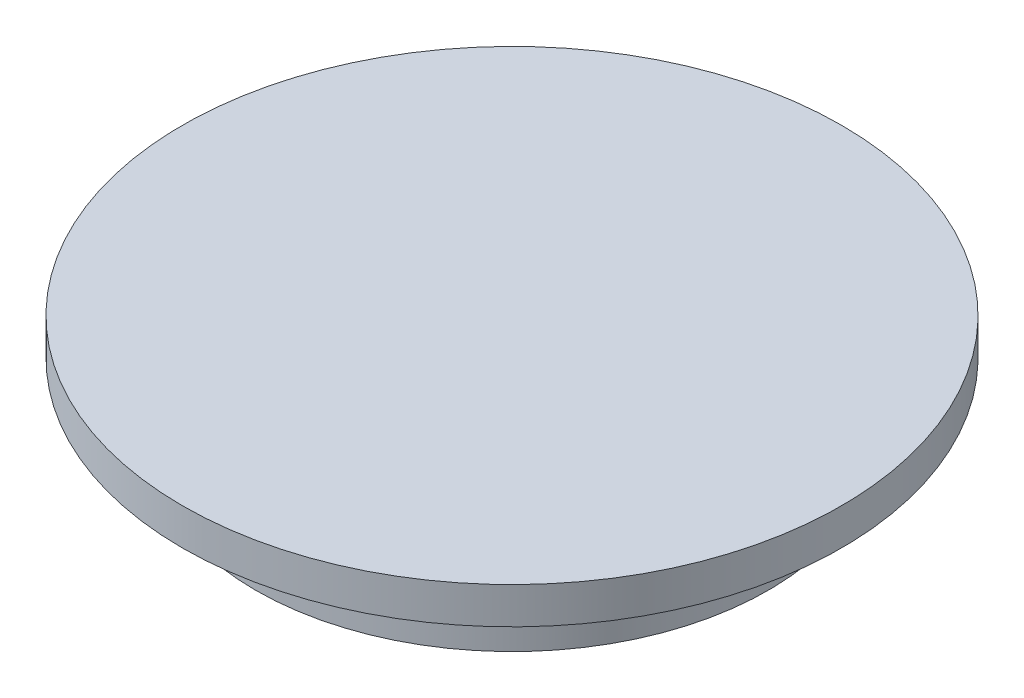
ISO-10303-21;
HEADER;
FILE_DESCRIPTION(('STEP AP214'),'2;1');
FILE_NAME('part.step','',(''),(''),'','','');
FILE_SCHEMA(('AUTOMOTIVE_DESIGN { 1 0 10303 214 1 1 1 1 }'));
ENDSEC;
DATA;
#1=APPLICATION_CONTEXT('core data for automotive mechanical design processes');
#2=APPLICATION_PROTOCOL_DEFINITION('international standard','automotive_design',2000,#1);
#3=PRODUCT_CONTEXT('',#1,'mechanical');
#4=PRODUCT('Part','Part','',(#3));
#5=PRODUCT_RELATED_PRODUCT_CATEGORY('part','',(#4));
#6=PRODUCT_DEFINITION_FORMATION('','',#4);
#7=PRODUCT_DEFINITION_CONTEXT('part definition',#1,'design');
#8=PRODUCT_DEFINITION('design','',#6,#7);
#9=PRODUCT_DEFINITION_SHAPE('','',#8);
#10=(LENGTH_UNIT() NAMED_UNIT(*) SI_UNIT(.MILLI.,.METRE.));
#11=(NAMED_UNIT(*) PLANE_ANGLE_UNIT() SI_UNIT($,.RADIAN.));
#12=(NAMED_UNIT(*) SI_UNIT($,.STERADIAN.) SOLID_ANGLE_UNIT());
#13=UNCERTAINTY_MEASURE_WITH_UNIT(LENGTH_MEASURE(1.E-05),#10,'distance_accuracy_value','');
#14=(GEOMETRIC_REPRESENTATION_CONTEXT(3) GLOBAL_UNCERTAINTY_ASSIGNED_CONTEXT((#13)) GLOBAL_UNIT_ASSIGNED_CONTEXT((#10,
#11,#12)) REPRESENTATION_CONTEXT('',''));
#15=CARTESIAN_POINT('',(0.,0.,0.));
#16=DIRECTION('',(0.,0.,1.));
#17=DIRECTION('',(1.,0.,0.));
#18=AXIS2_PLACEMENT_3D('',#15,#16,#17);
#19=CARTESIAN_POINT('',(0.,5.,0.));
#20=DIRECTION('',(0.,-1.,0.));
#21=DIRECTION('',(0.,0.,-1.));
#22=AXIS2_PLACEMENT_3D('',#19,#20,#21);
#23=CYLINDRICAL_SURFACE('',#22,17.5);
#24=CARTESIAN_POINT('',(0.,5.,0.));
#25=DIRECTION('',(0.,1.,0.));
#26=DIRECTION('',(0.,0.,1.));
#27=AXIS2_PLACEMENT_3D('',#24,#25,#26);
#28=CIRCLE('',#27,17.5);
#29=CARTESIAN_POINT('',(0.,5.,17.5));
#30=VERTEX_POINT('',#29);
#31=EDGE_CURVE('E10',#30,#30,#28,.T.);
#32=ORIENTED_EDGE('',*,*,#31,.F.);
#33=EDGE_LOOP('',(#32));
#34=FACE_BOUND('',#33,.T.);
#35=CARTESIAN_POINT('',(0.,0.,0.));
#36=DIRECTION('',(0.,1.,0.));
#37=DIRECTION('',(0.,0.,1.));
#38=AXIS2_PLACEMENT_3D('',#35,#36,#37);
#39=CIRCLE('',#38,17.5);
#40=CARTESIAN_POINT('',(0.,0.,17.5));
#41=VERTEX_POINT('',#40);
#42=EDGE_CURVE('E40',#41,#41,#39,.T.);
#43=ORIENTED_EDGE('',*,*,#42,.T.);
#44=EDGE_LOOP('',(#43));
#45=FACE_BOUND('',#44,.T.);
#46=ADVANCED_FACE('F37',(#34,#45),#23,.T.);
#47=CARTESIAN_POINT('',(0.,0.,0.));
#48=DIRECTION('',(0.,1.,0.));
#49=DIRECTION('',(0.,0.,1.));
#50=AXIS2_PLACEMENT_3D('',#47,#48,#49);
#51=PLANE('',#50);
#52=ORIENTED_EDGE('',*,*,#42,.F.);
#53=EDGE_LOOP('',(#52));
#54=FACE_BOUND('',#53,.T.);
#55=ADVANCED_FACE('F60',(#54),#51,.F.);
#56=CARTESIAN_POINT('',(0.,7.5,0.));
#57=DIRECTION('',(0.,-1.,0.));
#58=DIRECTION('',(0.,0.,-1.));
#59=AXIS2_PLACEMENT_3D('',#56,#57,#58);
#60=CYLINDRICAL_SURFACE('',#59,22.5);
#61=CARTESIAN_POINT('',(0.,7.5,0.));
#62=DIRECTION('',(0.,1.,0.));
#63=DIRECTION('',(0.,0.,1.));
#64=AXIS2_PLACEMENT_3D('',#61,#62,#63);
#65=CIRCLE('',#64,22.5);
#66=CARTESIAN_POINT('',(0.,7.5,22.5));
#67=VERTEX_POINT('',#66);
#68=EDGE_CURVE('E47',#67,#67,#65,.T.);
#69=ORIENTED_EDGE('',*,*,#68,.F.);
#70=EDGE_LOOP('',(#69));
#71=FACE_BOUND('',#70,.T.);
#72=CARTESIAN_POINT('',(0.,5.,0.));
#73=DIRECTION('',(0.,1.,0.));
#74=DIRECTION('',(0.,0.,1.));
#75=AXIS2_PLACEMENT_3D('',#72,#73,#74);
#76=CIRCLE('',#75,22.5);
#77=CARTESIAN_POINT('',(0.,5.,22.5));
#78=VERTEX_POINT('',#77);
#79=EDGE_CURVE('E49',#78,#78,#76,.T.);
#80=ORIENTED_EDGE('',*,*,#79,.T.);
#81=EDGE_LOOP('',(#80));
#82=FACE_BOUND('',#81,.T.);
#83=ADVANCED_FACE('F57',(#71,#82),#60,.T.);
#84=CARTESIAN_POINT('',(0.,7.5,0.));
#85=DIRECTION('',(0.,1.,0.));
#86=DIRECTION('',(0.,0.,1.));
#87=AXIS2_PLACEMENT_3D('',#84,#85,#86);
#88=PLANE('',#87);
#89=ORIENTED_EDGE('',*,*,#68,.T.);
#90=EDGE_LOOP('',(#89));
#91=FACE_BOUND('',#90,.T.);
#92=ADVANCED_FACE('F55',(#91),#88,.T.);
#93=CARTESIAN_POINT('',(0.,5.,0.));
#94=DIRECTION('',(0.,1.,0.));
#95=DIRECTION('',(0.,0.,1.));
#96=AXIS2_PLACEMENT_3D('',#93,#94,#95);
#97=PLANE('',#96);
#98=ORIENTED_EDGE('',*,*,#31,.T.);
#99=EDGE_LOOP('',(#98));
#100=FACE_BOUND('',#99,.T.);
#101=ORIENTED_EDGE('',*,*,#79,.F.);
#102=EDGE_LOOP('',(#101));
#103=FACE_BOUND('',#102,.T.);
#104=ADVANCED_FACE('F64',(#100,#103),#97,.F.);
#105=CLOSED_SHELL('',(#46,#55,#83,#92,#104));
#106=MANIFOLD_SOLID_BREP('B2',#105);
#107=ADVANCED_BREP_SHAPE_REPRESENTATION('',(#18,#106),#14);
#108=SHAPE_DEFINITION_REPRESENTATION(#9,#107);
ENDSEC;
END-ISO-10303-21;
